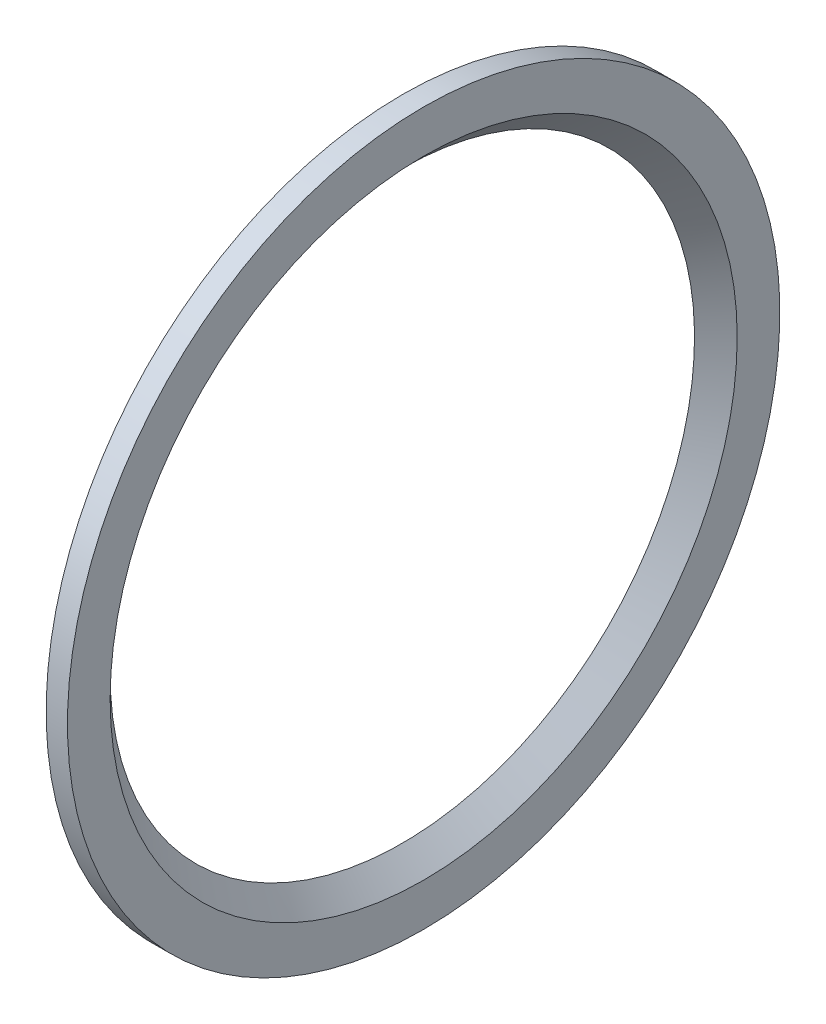
ISO-10303-21;
HEADER;
FILE_DESCRIPTION(('STEP AP214'),'2;1');
FILE_NAME('part.step','',(''),(''),'','','');
FILE_SCHEMA(('AUTOMOTIVE_DESIGN { 1 0 10303 214 1 1 1 1 }'));
ENDSEC;
DATA;
#1=APPLICATION_CONTEXT('core data for automotive mechanical design processes');
#2=APPLICATION_PROTOCOL_DEFINITION('international standard','automotive_design',2000,#1);
#3=PRODUCT_CONTEXT('',#1,'mechanical');
#4=PRODUCT('Part','Part','',(#3));
#5=PRODUCT_RELATED_PRODUCT_CATEGORY('part','',(#4));
#6=PRODUCT_DEFINITION_FORMATION('','',#4);
#7=PRODUCT_DEFINITION_CONTEXT('part definition',#1,'design');
#8=PRODUCT_DEFINITION('design','',#6,#7);
#9=PRODUCT_DEFINITION_SHAPE('','',#8);
#10=(LENGTH_UNIT() NAMED_UNIT(*) SI_UNIT(.MILLI.,.METRE.));
#11=(NAMED_UNIT(*) PLANE_ANGLE_UNIT() SI_UNIT($,.RADIAN.));
#12=(NAMED_UNIT(*) SI_UNIT($,.STERADIAN.) SOLID_ANGLE_UNIT());
#13=UNCERTAINTY_MEASURE_WITH_UNIT(LENGTH_MEASURE(1.E-05),#10,'distance_accuracy_value','');
#14=(GEOMETRIC_REPRESENTATION_CONTEXT(3) GLOBAL_UNCERTAINTY_ASSIGNED_CONTEXT((#13)) GLOBAL_UNIT_ASSIGNED_CONTEXT((#10,
#11,#12)) REPRESENTATION_CONTEXT('',''));
#15=CARTESIAN_POINT('',(0.,0.,0.));
#16=DIRECTION('',(0.,0.,1.));
#17=DIRECTION('',(1.,0.,0.));
#18=AXIS2_PLACEMENT_3D('',#15,#16,#17);
#19=CARTESIAN_POINT('',(-115.05,-33.4000000000001,0.));
#20=DIRECTION('',(-1.,0.,0.));
#21=DIRECTION('',(0.,-1.,0.));
#22=AXIS2_PLACEMENT_3D('',#19,#20,#21);
#23=PLANE('',#22);
#24=CARTESIAN_POINT('',(-115.05,0.,0.));
#25=DIRECTION('',(1.,0.,0.));
#26=DIRECTION('',(0.,1.,0.));
#27=AXIS2_PLACEMENT_3D('',#24,#25,#26);
#28=CIRCLE('',#27,29.4000000000002);
#29=CARTESIAN_POINT('',(-115.05,29.4000000000003,0.));
#30=VERTEX_POINT('',#29);
#31=EDGE_CURVE('E10',#30,#30,#28,.T.);
#32=ORIENTED_EDGE('',*,*,#31,.F.);
#33=EDGE_LOOP('',(#32));
#34=FACE_BOUND('',#33,.T.);
#35=CARTESIAN_POINT('',(-115.05,0.,0.));
#36=DIRECTION('',(1.,0.,0.));
#37=DIRECTION('',(0.,1.,0.));
#38=AXIS2_PLACEMENT_3D('',#35,#36,#37);
#39=CIRCLE('',#38,33.4000000000002);
#40=CARTESIAN_POINT('',(-115.05,33.4000000000002,0.));
#41=VERTEX_POINT('',#40);
#42=EDGE_CURVE('E48',#41,#41,#39,.T.);
#43=ORIENTED_EDGE('',*,*,#42,.T.);
#44=EDGE_LOOP('',(#43));
#45=FACE_BOUND('',#44,.T.);
#46=ADVANCED_FACE('F34',(#34,#45),#23,.F.);
#47=CARTESIAN_POINT('',(-115.05,0.,0.));
#48=DIRECTION('',(1.,0.,0.));
#49=DIRECTION('',(0.,1.,0.));
#50=AXIS2_PLACEMENT_3D('',#47,#48,#49);
#51=CONICAL_SURFACE('',#50,29.4000000000002,0.785398163397448);
#52=CARTESIAN_POINT('',(-117.05,0.,0.));
#53=DIRECTION('',(1.,0.,0.));
#54=DIRECTION('',(0.,1.,0.));
#55=AXIS2_PLACEMENT_3D('',#52,#53,#54);
#56=CIRCLE('',#55,27.4000000000002);
#57=CARTESIAN_POINT('',(-117.05,27.4000000000003,0.));
#58=VERTEX_POINT('',#57);
#59=EDGE_CURVE('E40',#58,#58,#56,.T.);
#60=ORIENTED_EDGE('',*,*,#59,.F.);
#61=EDGE_LOOP('',(#60));
#62=FACE_BOUND('',#61,.T.);
#63=ORIENTED_EDGE('',*,*,#31,.T.);
#64=EDGE_LOOP('',(#63));
#65=FACE_BOUND('',#64,.T.);
#66=ADVANCED_FACE('F63',(#62,#65),#51,.F.);
#67=CARTESIAN_POINT('',(-117.05,-33.4000000000001,0.));
#68=DIRECTION('',(1.,0.,0.));
#69=DIRECTION('',(0.,1.,0.));
#70=AXIS2_PLACEMENT_3D('',#67,#68,#69);
#71=PLANE('',#70);
#72=CARTESIAN_POINT('',(-117.05,0.,0.));
#73=DIRECTION('',(1.,0.,0.));
#74=DIRECTION('',(0.,1.,0.));
#75=AXIS2_PLACEMENT_3D('',#72,#73,#74);
#76=CIRCLE('',#75,33.4000000000002);
#77=CARTESIAN_POINT('',(-117.05,33.4000000000002,0.));
#78=VERTEX_POINT('',#77);
#79=EDGE_CURVE('E44',#78,#78,#76,.T.);
#80=ORIENTED_EDGE('',*,*,#79,.F.);
#81=EDGE_LOOP('',(#80));
#82=FACE_BOUND('',#81,.T.);
#83=ORIENTED_EDGE('',*,*,#59,.T.);
#84=EDGE_LOOP('',(#83));
#85=FACE_BOUND('',#84,.T.);
#86=ADVANCED_FACE('F58',(#82,#85),#71,.F.);
#87=CARTESIAN_POINT('',(-67.4822610575465,0.,0.));
#88=DIRECTION('',(1.,0.,0.));
#89=DIRECTION('',(0.,1.,0.));
#90=AXIS2_PLACEMENT_3D('',#87,#88,#89);
#91=CYLINDRICAL_SURFACE('',#90,33.4000000000002);
#92=ORIENTED_EDGE('',*,*,#42,.F.);
#93=EDGE_LOOP('',(#92));
#94=FACE_BOUND('',#93,.T.);
#95=ORIENTED_EDGE('',*,*,#79,.T.);
#96=EDGE_LOOP('',(#95));
#97=FACE_BOUND('',#96,.T.);
#98=ADVANCED_FACE('F55',(#94,#97),#91,.T.);
#99=CLOSED_SHELL('',(#46,#66,#86,#98));
#100=MANIFOLD_SOLID_BREP('B2',#99);
#101=ADVANCED_BREP_SHAPE_REPRESENTATION('',(#18,#100),#14);
#102=SHAPE_DEFINITION_REPRESENTATION(#9,#101);
ENDSEC;
END-ISO-10303-21;
